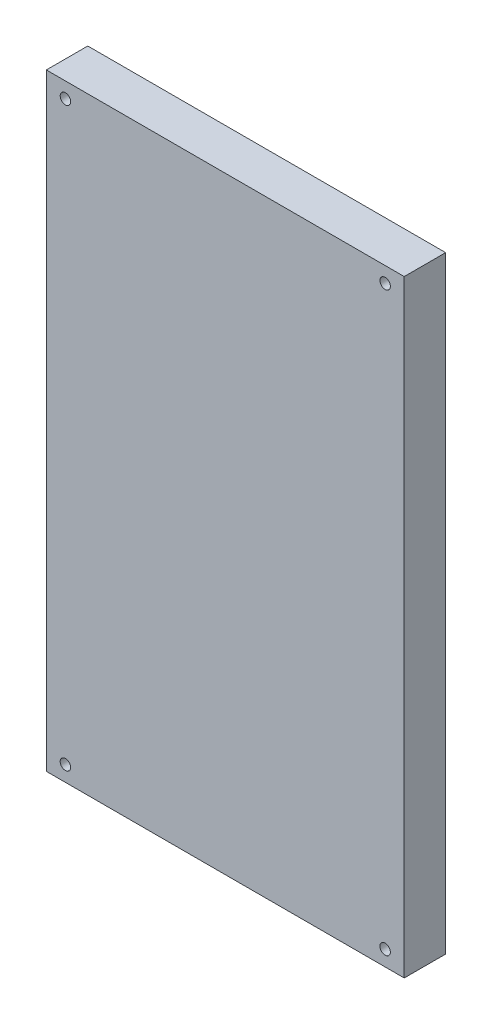
ISO-10303-21;
HEADER;
FILE_DESCRIPTION(('STEP AP214'),'2;1');
FILE_NAME('part.step','',(''),(''),'','','');
FILE_SCHEMA(('AUTOMOTIVE_DESIGN { 1 0 10303 214 1 1 1 1 }'));
ENDSEC;
DATA;
#1=APPLICATION_CONTEXT('core data for automotive mechanical design processes');
#2=APPLICATION_PROTOCOL_DEFINITION('international standard','automotive_design',2000,#1);
#3=PRODUCT_CONTEXT('',#1,'mechanical');
#4=PRODUCT('Part','Part','',(#3));
#5=PRODUCT_RELATED_PRODUCT_CATEGORY('part','',(#4));
#6=PRODUCT_DEFINITION_FORMATION('','',#4);
#7=PRODUCT_DEFINITION_CONTEXT('part definition',#1,'design');
#8=PRODUCT_DEFINITION('design','',#6,#7);
#9=PRODUCT_DEFINITION_SHAPE('','',#8);
#10=(LENGTH_UNIT() NAMED_UNIT(*) SI_UNIT(.MILLI.,.METRE.));
#11=(NAMED_UNIT(*) PLANE_ANGLE_UNIT() SI_UNIT($,.RADIAN.));
#12=(NAMED_UNIT(*) SI_UNIT($,.STERADIAN.) SOLID_ANGLE_UNIT());
#13=UNCERTAINTY_MEASURE_WITH_UNIT(LENGTH_MEASURE(1.E-05),#10,'distance_accuracy_value','');
#14=(GEOMETRIC_REPRESENTATION_CONTEXT(3) GLOBAL_UNCERTAINTY_ASSIGNED_CONTEXT((#13)) GLOBAL_UNIT_ASSIGNED_CONTEXT((#10,
#11,#12)) REPRESENTATION_CONTEXT('',''));
#15=CARTESIAN_POINT('',(0.,0.,0.));
#16=DIRECTION('',(0.,0.,1.));
#17=DIRECTION('',(1.,0.,0.));
#18=AXIS2_PLACEMENT_3D('',#15,#16,#17);
#19=CARTESIAN_POINT('',(0.,0.,12.55));
#20=DIRECTION('',(0.,0.,-1.));
#21=DIRECTION('',(-1.,0.,0.));
#22=AXIS2_PLACEMENT_3D('',#19,#20,#21);
#23=PLANE('',#22);
#24=DIRECTION('',(0.,-1.,0.));
#25=VECTOR('',#24,1.);
#26=CARTESIAN_POINT('',(0.,0.,12.55));
#27=LINE('',#26,#25);
#28=CARTESIAN_POINT('',(0.,184.,12.55));
#29=VERTEX_POINT('',#28);
#30=CARTESIAN_POINT('',(0.,0.,12.55));
#31=VERTEX_POINT('',#30);
#32=EDGE_CURVE('E92',#29,#31,#27,.T.);
#33=ORIENTED_EDGE('',*,*,#32,.T.);
#34=DIRECTION('',(1.,0.,0.));
#35=VECTOR('',#34,1.);
#36=CARTESIAN_POINT('',(0.,0.,12.55));
#37=LINE('',#36,#35);
#38=CARTESIAN_POINT('',(108.4,0.,12.55));
#39=VERTEX_POINT('',#38);
#40=EDGE_CURVE('E87',#31,#39,#37,.T.);
#41=ORIENTED_EDGE('',*,*,#40,.T.);
#42=DIRECTION('',(0.,1.,0.));
#43=VECTOR('',#42,1.);
#44=CARTESIAN_POINT('',(108.4,0.,12.55));
#45=LINE('',#44,#43);
#46=CARTESIAN_POINT('',(108.4,184.,12.55));
#47=VERTEX_POINT('',#46);
#48=EDGE_CURVE('E90',#39,#47,#45,.T.);
#49=ORIENTED_EDGE('',*,*,#48,.T.);
#50=DIRECTION('',(-1.,0.,0.));
#51=VECTOR('',#50,1.);
#52=CARTESIAN_POINT('',(0.,184.,12.55));
#53=LINE('',#52,#51);
#54=EDGE_CURVE('E57',#47,#29,#53,.T.);
#55=ORIENTED_EDGE('',*,*,#54,.T.);
#56=EDGE_LOOP('',(#33,#41,#49,#55));
#57=FACE_BOUND('',#56,.T.);
#58=CARTESIAN_POINT('',(5.78124999999981,4.6875,12.55));
#59=DIRECTION('',(0.,0.,1.));
#60=DIRECTION('',(1.,0.,0.));
#61=AXIS2_PLACEMENT_3D('',#58,#59,#60);
#62=CIRCLE('',#61,1.5875);
#63=CARTESIAN_POINT('',(7.36874999999981,4.6875,12.55));
#64=VERTEX_POINT('',#63);
#65=EDGE_CURVE('E112',#64,#64,#62,.T.);
#66=ORIENTED_EDGE('',*,*,#65,.F.);
#67=EDGE_LOOP('',(#66));
#68=FACE_BOUND('',#67,.T.);
#69=CARTESIAN_POINT('',(102.61875,4.6875,12.55));
#70=DIRECTION('',(0.,0.,1.));
#71=DIRECTION('',(1.,0.,0.));
#72=AXIS2_PLACEMENT_3D('',#69,#70,#71);
#73=CIRCLE('',#72,1.5875);
#74=CARTESIAN_POINT('',(104.20625,4.6875,12.55));
#75=VERTEX_POINT('',#74);
#76=EDGE_CURVE('E134',#75,#75,#73,.T.);
#77=ORIENTED_EDGE('',*,*,#76,.F.);
#78=EDGE_LOOP('',(#77));
#79=FACE_BOUND('',#78,.T.);
#80=CARTESIAN_POINT('',(5.78124999999981,179.3125,12.55));
#81=DIRECTION('',(0.,0.,1.));
#82=DIRECTION('',(1.,0.,0.));
#83=AXIS2_PLACEMENT_3D('',#80,#81,#82);
#84=CIRCLE('',#83,1.5875);
#85=CARTESIAN_POINT('',(7.36874999999981,179.3125,12.55));
#86=VERTEX_POINT('',#85);
#87=EDGE_CURVE('E142',#86,#86,#84,.T.);
#88=ORIENTED_EDGE('',*,*,#87,.F.);
#89=EDGE_LOOP('',(#88));
#90=FACE_BOUND('',#89,.T.);
#91=CARTESIAN_POINT('',(102.61875,179.3125,12.55));
#92=DIRECTION('',(0.,0.,1.));
#93=DIRECTION('',(1.,0.,0.));
#94=AXIS2_PLACEMENT_3D('',#91,#92,#93);
#95=CIRCLE('',#94,1.58749999999999);
#96=CARTESIAN_POINT('',(104.20625,179.3125,12.55));
#97=VERTEX_POINT('',#96);
#98=EDGE_CURVE('E150',#97,#97,#95,.T.);
#99=ORIENTED_EDGE('',*,*,#98,.F.);
#100=EDGE_LOOP('',(#99));
#101=FACE_BOUND('',#100,.T.);
#102=ADVANCED_FACE('F39',(#57,#68,#79,#90,#101),#23,.F.);
#103=CARTESIAN_POINT('',(0.,0.,0.));
#104=DIRECTION('',(0.,0.,-1.));
#105=DIRECTION('',(-1.,0.,0.));
#106=AXIS2_PLACEMENT_3D('',#103,#104,#105);
#107=PLANE('',#106);
#108=CARTESIAN_POINT('',(5.78124999999981,179.3125,0.));
#109=DIRECTION('',(0.,0.,1.));
#110=DIRECTION('',(1.,0.,0.));
#111=AXIS2_PLACEMENT_3D('',#108,#109,#110);
#112=CIRCLE('',#111,1.5875);
#113=CARTESIAN_POINT('',(7.36874999999981,179.3125,0.));
#114=VERTEX_POINT('',#113);
#115=EDGE_CURVE('E146',#114,#114,#112,.T.);
#116=ORIENTED_EDGE('',*,*,#115,.T.);
#117=EDGE_LOOP('',(#116));
#118=FACE_BOUND('',#117,.T.);
#119=CARTESIAN_POINT('',(5.78124999999981,4.6875,0.));
#120=DIRECTION('',(0.,0.,1.));
#121=DIRECTION('',(1.,0.,0.));
#122=AXIS2_PLACEMENT_3D('',#119,#120,#121);
#123=CIRCLE('',#122,1.5875);
#124=CARTESIAN_POINT('',(7.36874999999981,4.6875,0.));
#125=VERTEX_POINT('',#124);
#126=EDGE_CURVE('E130',#125,#125,#123,.T.);
#127=ORIENTED_EDGE('',*,*,#126,.T.);
#128=EDGE_LOOP('',(#127));
#129=FACE_BOUND('',#128,.T.);
#130=DIRECTION('',(0.,-1.,0.));
#131=VECTOR('',#130,1.);
#132=CARTESIAN_POINT('',(0.,0.,0.));
#133=LINE('',#132,#131);
#134=CARTESIAN_POINT('',(0.,184.,0.));
#135=VERTEX_POINT('',#134);
#136=CARTESIAN_POINT('',(0.,0.,0.));
#137=VERTEX_POINT('',#136);
#138=EDGE_CURVE('E108',#135,#137,#133,.T.);
#139=ORIENTED_EDGE('',*,*,#138,.F.);
#140=DIRECTION('',(-1.,0.,0.));
#141=VECTOR('',#140,1.);
#142=CARTESIAN_POINT('',(0.,184.,0.));
#143=LINE('',#142,#141);
#144=CARTESIAN_POINT('',(108.4,184.,0.));
#145=VERTEX_POINT('',#144);
#146=EDGE_CURVE('E80',#145,#135,#143,.T.);
#147=ORIENTED_EDGE('',*,*,#146,.F.);
#148=DIRECTION('',(0.,1.,0.));
#149=VECTOR('',#148,1.);
#150=CARTESIAN_POINT('',(108.4,0.,0.));
#151=LINE('',#150,#149);
#152=CARTESIAN_POINT('',(108.4,0.,0.));
#153=VERTEX_POINT('',#152);
#154=EDGE_CURVE('E74',#153,#145,#151,.T.);
#155=ORIENTED_EDGE('',*,*,#154,.F.);
#156=DIRECTION('',(1.,0.,0.));
#157=VECTOR('',#156,1.);
#158=CARTESIAN_POINT('',(0.,0.,0.));
#159=LINE('',#158,#157);
#160=EDGE_CURVE('E97',#137,#153,#159,.T.);
#161=ORIENTED_EDGE('',*,*,#160,.F.);
#162=EDGE_LOOP('',(#139,#147,#155,#161));
#163=FACE_BOUND('',#162,.T.);
#164=CARTESIAN_POINT('',(102.61875,4.6875,0.));
#165=DIRECTION('',(0.,0.,1.));
#166=DIRECTION('',(1.,0.,0.));
#167=AXIS2_PLACEMENT_3D('',#164,#165,#166);
#168=CIRCLE('',#167,1.5875);
#169=CARTESIAN_POINT('',(104.20625,4.6875,0.));
#170=VERTEX_POINT('',#169);
#171=EDGE_CURVE('E138',#170,#170,#168,.T.);
#172=ORIENTED_EDGE('',*,*,#171,.T.);
#173=EDGE_LOOP('',(#172));
#174=FACE_BOUND('',#173,.T.);
#175=CARTESIAN_POINT('',(102.61875,179.3125,0.));
#176=DIRECTION('',(0.,0.,1.));
#177=DIRECTION('',(1.,0.,0.));
#178=AXIS2_PLACEMENT_3D('',#175,#176,#177);
#179=CIRCLE('',#178,1.58749999999999);
#180=CARTESIAN_POINT('',(104.20625,179.3125,0.));
#181=VERTEX_POINT('',#180);
#182=EDGE_CURVE('E154',#181,#181,#179,.T.);
#183=ORIENTED_EDGE('',*,*,#182,.T.);
#184=EDGE_LOOP('',(#183));
#185=FACE_BOUND('',#184,.T.);
#186=ADVANCED_FACE('F125',(#118,#129,#163,#174,#185),#107,.T.);
#187=CARTESIAN_POINT('',(0.,0.,12.55));
#188=DIRECTION('',(1.,0.,0.));
#189=DIRECTION('',(0.,0.,-1.));
#190=AXIS2_PLACEMENT_3D('',#187,#188,#189);
#191=PLANE('',#190);
#192=ORIENTED_EDGE('',*,*,#138,.T.);
#193=DIRECTION('',(0.,0.,-1.));
#194=VECTOR('',#193,1.);
#195=CARTESIAN_POINT('',(0.,0.,12.55));
#196=LINE('',#195,#194);
#197=EDGE_CURVE('E11',#31,#137,#196,.T.);
#198=ORIENTED_EDGE('',*,*,#197,.F.);
#199=ORIENTED_EDGE('',*,*,#32,.F.);
#200=DIRECTION('',(0.,0.,-1.));
#201=VECTOR('',#200,1.);
#202=CARTESIAN_POINT('',(0.,184.,12.55));
#203=LINE('',#202,#201);
#204=EDGE_CURVE('E104',#29,#135,#203,.T.);
#205=ORIENTED_EDGE('',*,*,#204,.T.);
#206=EDGE_LOOP('',(#192,#198,#199,#205));
#207=FACE_BOUND('',#206,.T.);
#208=ADVANCED_FACE('F41',(#207),#191,.F.);
#209=CARTESIAN_POINT('',(0.,0.,12.55));
#210=DIRECTION('',(0.,1.,0.));
#211=DIRECTION('',(0.,0.,1.));
#212=AXIS2_PLACEMENT_3D('',#209,#210,#211);
#213=PLANE('',#212);
#214=ORIENTED_EDGE('',*,*,#160,.T.);
#215=DIRECTION('',(0.,0.,-1.));
#216=VECTOR('',#215,1.);
#217=CARTESIAN_POINT('',(108.4,0.,12.55));
#218=LINE('',#217,#216);
#219=EDGE_CURVE('E49',#39,#153,#218,.T.);
#220=ORIENTED_EDGE('',*,*,#219,.F.);
#221=ORIENTED_EDGE('',*,*,#40,.F.);
#222=ORIENTED_EDGE('',*,*,#197,.T.);
#223=EDGE_LOOP('',(#214,#220,#221,#222));
#224=FACE_BOUND('',#223,.T.);
#225=ADVANCED_FACE('F96',(#224),#213,.F.);
#226=CARTESIAN_POINT('',(108.4,0.,12.55));
#227=DIRECTION('',(-1.,0.,0.));
#228=DIRECTION('',(0.,0.,1.));
#229=AXIS2_PLACEMENT_3D('',#226,#227,#228);
#230=PLANE('',#229);
#231=ORIENTED_EDGE('',*,*,#154,.T.);
#232=DIRECTION('',(0.,0.,-1.));
#233=VECTOR('',#232,1.);
#234=CARTESIAN_POINT('',(108.4,184.,12.55));
#235=LINE('',#234,#233);
#236=EDGE_CURVE('E99',#47,#145,#235,.T.);
#237=ORIENTED_EDGE('',*,*,#236,.F.);
#238=ORIENTED_EDGE('',*,*,#48,.F.);
#239=ORIENTED_EDGE('',*,*,#219,.T.);
#240=EDGE_LOOP('',(#231,#237,#238,#239));
#241=FACE_BOUND('',#240,.T.);
#242=ADVANCED_FACE('F100',(#241),#230,.F.);
#243=CARTESIAN_POINT('',(0.,184.,12.55));
#244=DIRECTION('',(0.,-1.,0.));
#245=DIRECTION('',(1.,0.,0.));
#246=AXIS2_PLACEMENT_3D('',#243,#244,#245);
#247=PLANE('',#246);
#248=ORIENTED_EDGE('',*,*,#146,.T.);
#249=ORIENTED_EDGE('',*,*,#204,.F.);
#250=ORIENTED_EDGE('',*,*,#54,.F.);
#251=ORIENTED_EDGE('',*,*,#236,.T.);
#252=EDGE_LOOP('',(#248,#249,#250,#251));
#253=FACE_BOUND('',#252,.T.);
#254=ADVANCED_FACE('F122',(#253),#247,.F.);
#255=CARTESIAN_POINT('',(5.78124999999981,4.6875,12.55));
#256=DIRECTION('',(0.,0.,-1.));
#257=DIRECTION('',(-1.,0.,0.));
#258=AXIS2_PLACEMENT_3D('',#255,#256,#257);
#259=CYLINDRICAL_SURFACE('',#258,1.5875);
#260=ORIENTED_EDGE('',*,*,#65,.T.);
#261=EDGE_LOOP('',(#260));
#262=FACE_BOUND('',#261,.T.);
#263=ORIENTED_EDGE('',*,*,#126,.F.);
#264=EDGE_LOOP('',(#263));
#265=FACE_BOUND('',#264,.T.);
#266=ADVANCED_FACE('F173',(#262,#265),#259,.F.);
#267=CARTESIAN_POINT('',(102.61875,4.6875,12.55));
#268=DIRECTION('',(0.,0.,-1.));
#269=DIRECTION('',(-1.,0.,0.));
#270=AXIS2_PLACEMENT_3D('',#267,#268,#269);
#271=CYLINDRICAL_SURFACE('',#270,1.5875);
#272=ORIENTED_EDGE('',*,*,#76,.T.);
#273=EDGE_LOOP('',(#272));
#274=FACE_BOUND('',#273,.T.);
#275=ORIENTED_EDGE('',*,*,#171,.F.);
#276=EDGE_LOOP('',(#275));
#277=FACE_BOUND('',#276,.T.);
#278=ADVANCED_FACE('F219',(#274,#277),#271,.F.);
#279=CARTESIAN_POINT('',(5.78124999999981,179.3125,12.55));
#280=DIRECTION('',(0.,0.,-1.));
#281=DIRECTION('',(-1.,0.,0.));
#282=AXIS2_PLACEMENT_3D('',#279,#280,#281);
#283=CYLINDRICAL_SURFACE('',#282,1.5875);
#284=ORIENTED_EDGE('',*,*,#87,.T.);
#285=EDGE_LOOP('',(#284));
#286=FACE_BOUND('',#285,.T.);
#287=ORIENTED_EDGE('',*,*,#115,.F.);
#288=EDGE_LOOP('',(#287));
#289=FACE_BOUND('',#288,.T.);
#290=ADVANCED_FACE('F227',(#286,#289),#283,.F.);
#291=CARTESIAN_POINT('',(102.61875,179.3125,12.55));
#292=DIRECTION('',(0.,0.,-1.));
#293=DIRECTION('',(-1.,0.,0.));
#294=AXIS2_PLACEMENT_3D('',#291,#292,#293);
#295=CYLINDRICAL_SURFACE('',#294,1.58749999999999);
#296=ORIENTED_EDGE('',*,*,#98,.T.);
#297=EDGE_LOOP('',(#296));
#298=FACE_BOUND('',#297,.T.);
#299=ORIENTED_EDGE('',*,*,#182,.F.);
#300=EDGE_LOOP('',(#299));
#301=FACE_BOUND('',#300,.T.);
#302=ADVANCED_FACE('F162',(#298,#301),#295,.F.);
#303=CLOSED_SHELL('',(#102,#186,#208,#225,#242,#254,#266,#278,#290,#302));
#304=MANIFOLD_SOLID_BREP('B2',#303);
#305=ADVANCED_BREP_SHAPE_REPRESENTATION('',(#18,#304),#14);
#306=SHAPE_DEFINITION_REPRESENTATION(#9,#305);
ENDSEC;
END-ISO-10303-21;
